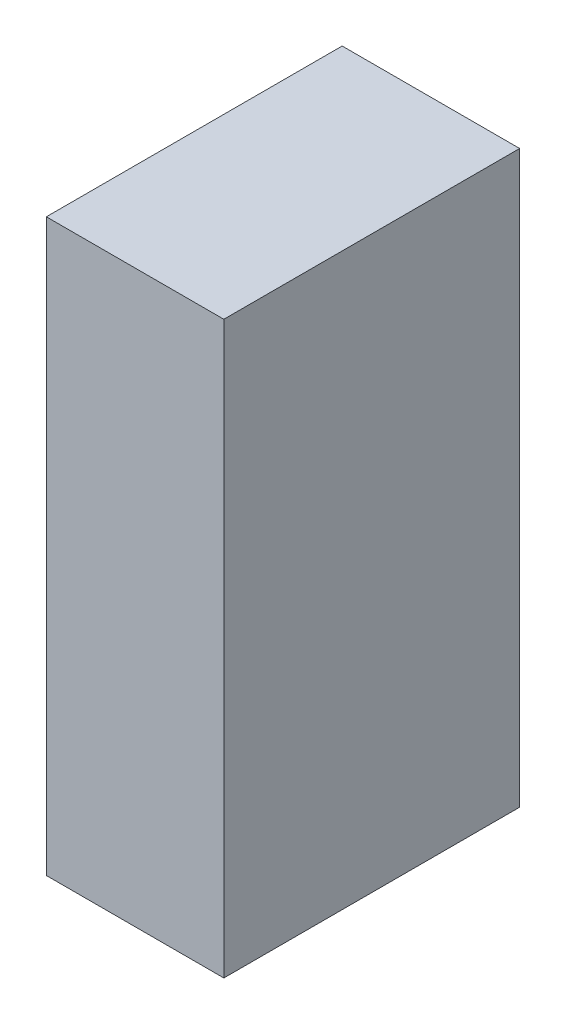
ISO-10303-21;
HEADER;
FILE_DESCRIPTION(('STEP AP214'),'2;1');
FILE_NAME('part.step','',(''),(''),'','','');
FILE_SCHEMA(('AUTOMOTIVE_DESIGN { 1 0 10303 214 1 1 1 1 }'));
ENDSEC;
DATA;
#1=APPLICATION_CONTEXT('core data for automotive mechanical design processes');
#2=APPLICATION_PROTOCOL_DEFINITION('international standard','automotive_design',2000,#1);
#3=PRODUCT_CONTEXT('',#1,'mechanical');
#4=PRODUCT('Part','Part','',(#3));
#5=PRODUCT_RELATED_PRODUCT_CATEGORY('part','',(#4));
#6=PRODUCT_DEFINITION_FORMATION('','',#4);
#7=PRODUCT_DEFINITION_CONTEXT('part definition',#1,'design');
#8=PRODUCT_DEFINITION('design','',#6,#7);
#9=PRODUCT_DEFINITION_SHAPE('','',#8);
#10=(LENGTH_UNIT() NAMED_UNIT(*) SI_UNIT(.MILLI.,.METRE.));
#11=(NAMED_UNIT(*) PLANE_ANGLE_UNIT() SI_UNIT($,.RADIAN.));
#12=(NAMED_UNIT(*) SI_UNIT($,.STERADIAN.) SOLID_ANGLE_UNIT());
#13=UNCERTAINTY_MEASURE_WITH_UNIT(LENGTH_MEASURE(1.E-05),#10,'distance_accuracy_value','');
#14=(GEOMETRIC_REPRESENTATION_CONTEXT(3) GLOBAL_UNCERTAINTY_ASSIGNED_CONTEXT((#13)) GLOBAL_UNIT_ASSIGNED_CONTEXT((#10,
#11,#12)) REPRESENTATION_CONTEXT('',''));
#15=CARTESIAN_POINT('',(0.,0.,0.));
#16=DIRECTION('',(0.,0.,1.));
#17=DIRECTION('',(1.,0.,0.));
#18=AXIS2_PLACEMENT_3D('',#15,#16,#17);
#19=CARTESIAN_POINT('',(0.21000212,0.67499992,0.));
#20=DIRECTION('',(1.,0.,0.));
#21=DIRECTION('',(0.,-1.,0.));
#22=AXIS2_PLACEMENT_3D('',#19,#20,#21);
#23=PLANE('',#22);
#24=DIRECTION('',(0.,0.,1.));
#25=VECTOR('',#24,1.);
#26=CARTESIAN_POINT('',(0.21000212,0.67499992,0.));
#27=LINE('',#26,#25);
#28=CARTESIAN_POINT('',(0.21000212,0.67499992,0.));
#29=VERTEX_POINT('',#28);
#30=CARTESIAN_POINT('',(0.21000212,0.67499992,0.70000114));
#31=VERTEX_POINT('',#30);
#32=EDGE_CURVE('E11',#29,#31,#27,.T.);
#33=ORIENTED_EDGE('',*,*,#32,.T.);
#34=DIRECTION('',(0.,-1.,0.));
#35=VECTOR('',#34,1.);
#36=CARTESIAN_POINT('',(0.21000212,0.67499992,0.70000114));
#37=LINE('',#36,#35);
#38=CARTESIAN_POINT('',(0.21000212,-0.67499992,0.70000114));
#39=VERTEX_POINT('',#38);
#40=EDGE_CURVE('E24',#31,#39,#37,.T.);
#41=ORIENTED_EDGE('',*,*,#40,.T.);
#42=DIRECTION('',(0.,0.,1.));
#43=VECTOR('',#42,1.);
#44=CARTESIAN_POINT('',(0.21000212,-0.67499992,0.));
#45=LINE('',#44,#43);
#46=CARTESIAN_POINT('',(0.21000212,-0.67499992,0.));
#47=VERTEX_POINT('',#46);
#48=EDGE_CURVE('E85',#47,#39,#45,.T.);
#49=ORIENTED_EDGE('',*,*,#48,.F.);
#50=DIRECTION('',(0.,-1.,0.));
#51=VECTOR('',#50,1.);
#52=CARTESIAN_POINT('',(0.21000212,0.67499992,0.));
#53=LINE('',#52,#51);
#54=EDGE_CURVE('E83',#29,#47,#53,.T.);
#55=ORIENTED_EDGE('',*,*,#54,.F.);
#56=EDGE_LOOP('',(#33,#41,#49,#55));
#57=FACE_BOUND('',#56,.T.);
#58=ADVANCED_FACE('F17',(#57),#23,.T.);
#59=CARTESIAN_POINT('',(0.21000212,-0.67499992,0.));
#60=DIRECTION('',(0.,-1.,0.));
#61=DIRECTION('',(-1.,0.,0.));
#62=AXIS2_PLACEMENT_3D('',#59,#60,#61);
#63=PLANE('',#62);
#64=ORIENTED_EDGE('',*,*,#48,.T.);
#65=DIRECTION('',(-1.,0.,0.));
#66=VECTOR('',#65,1.);
#67=CARTESIAN_POINT('',(0.21000212,-0.67499992,0.70000114));
#68=LINE('',#67,#66);
#69=CARTESIAN_POINT('',(-0.20999704,-0.67499992,0.70000114));
#70=VERTEX_POINT('',#69);
#71=EDGE_CURVE('E81',#39,#70,#68,.T.);
#72=ORIENTED_EDGE('',*,*,#71,.T.);
#73=DIRECTION('',(0.,0.,1.));
#74=VECTOR('',#73,1.);
#75=CARTESIAN_POINT('',(-0.20999704,-0.67499992,0.));
#76=LINE('',#75,#74);
#77=CARTESIAN_POINT('',(-0.20999704,-0.67499992,0.));
#78=VERTEX_POINT('',#77);
#79=EDGE_CURVE('E79',#78,#70,#76,.T.);
#80=ORIENTED_EDGE('',*,*,#79,.F.);
#81=DIRECTION('',(-1.,0.,0.));
#82=VECTOR('',#81,1.);
#83=CARTESIAN_POINT('',(0.21000212,-0.67499992,0.));
#84=LINE('',#83,#82);
#85=EDGE_CURVE('E70',#47,#78,#84,.T.);
#86=ORIENTED_EDGE('',*,*,#85,.F.);
#87=EDGE_LOOP('',(#64,#72,#80,#86));
#88=FACE_BOUND('',#87,.T.);
#89=ADVANCED_FACE('F90',(#88),#63,.T.);
#90=CARTESIAN_POINT('',(-0.20999704,-0.67499992,0.));
#91=DIRECTION('',(-0.99999999999823,-1.88148170224543E-06,0.));
#92=DIRECTION('',(-1.88148170224543E-06,0.99999999999823,0.));
#93=AXIS2_PLACEMENT_3D('',#90,#91,#92);
#94=PLANE('',#93);
#95=ORIENTED_EDGE('',*,*,#79,.T.);
#96=DIRECTION('',(-1.88148170224543E-06,0.99999999999823,0.));
#97=VECTOR('',#96,1.);
#98=CARTESIAN_POINT('',(-0.20999704,-0.67499992,0.70000114));
#99=LINE('',#98,#97);
#100=CARTESIAN_POINT('',(-0.20999958,0.67499992,0.70000114));
#101=VERTEX_POINT('',#100);
#102=EDGE_CURVE('E60',#70,#101,#99,.T.);
#103=ORIENTED_EDGE('',*,*,#102,.T.);
#104=DIRECTION('',(0.,0.,1.));
#105=VECTOR('',#104,1.);
#106=CARTESIAN_POINT('',(-0.20999958,0.67499992,0.));
#107=LINE('',#106,#105);
#108=CARTESIAN_POINT('',(-0.20999958,0.67499992,0.));
#109=VERTEX_POINT('',#108);
#110=EDGE_CURVE('E54',#109,#101,#107,.T.);
#111=ORIENTED_EDGE('',*,*,#110,.F.);
#112=DIRECTION('',(-1.88148170224543E-06,0.99999999999823,0.));
#113=VECTOR('',#112,1.);
#114=CARTESIAN_POINT('',(-0.20999704,-0.67499992,0.));
#115=LINE('',#114,#113);
#116=EDGE_CURVE('E58',#78,#109,#115,.T.);
#117=ORIENTED_EDGE('',*,*,#116,.F.);
#118=EDGE_LOOP('',(#95,#103,#111,#117));
#119=FACE_BOUND('',#118,.T.);
#120=ADVANCED_FACE('F57',(#119),#94,.T.);
#121=CARTESIAN_POINT('',(-0.20999958,0.67499992,0.));
#122=DIRECTION('',(0.,1.,0.));
#123=DIRECTION('',(1.,0.,0.));
#124=AXIS2_PLACEMENT_3D('',#121,#122,#123);
#125=PLANE('',#124);
#126=ORIENTED_EDGE('',*,*,#110,.T.);
#127=DIRECTION('',(1.,0.,0.));
#128=VECTOR('',#127,1.);
#129=CARTESIAN_POINT('',(-0.20999958,0.67499992,0.70000114));
#130=LINE('',#129,#128);
#131=EDGE_CURVE('E71',#101,#31,#130,.T.);
#132=ORIENTED_EDGE('',*,*,#131,.T.);
#133=ORIENTED_EDGE('',*,*,#32,.F.);
#134=DIRECTION('',(1.,0.,0.));
#135=VECTOR('',#134,1.);
#136=CARTESIAN_POINT('',(-0.20999958,0.67499992,0.));
#137=LINE('',#136,#135);
#138=EDGE_CURVE('E68',#109,#29,#137,.T.);
#139=ORIENTED_EDGE('',*,*,#138,.F.);
#140=EDGE_LOOP('',(#126,#132,#133,#139));
#141=FACE_BOUND('',#140,.T.);
#142=ADVANCED_FACE('F73',(#141),#125,.T.);
#143=CARTESIAN_POINT('',(0.21000212,0.67499992,0.));
#144=DIRECTION('',(0.,0.,1.));
#145=DIRECTION('',(1.,0.,0.));
#146=AXIS2_PLACEMENT_3D('',#143,#144,#145);
#147=PLANE('',#146);
#148=ORIENTED_EDGE('',*,*,#54,.T.);
#149=ORIENTED_EDGE('',*,*,#85,.T.);
#150=ORIENTED_EDGE('',*,*,#116,.T.);
#151=ORIENTED_EDGE('',*,*,#138,.T.);
#152=EDGE_LOOP('',(#148,#149,#150,#151));
#153=FACE_BOUND('',#152,.T.);
#154=ADVANCED_FACE('F67',(#153),#147,.F.);
#155=CARTESIAN_POINT('',(0.21000212,0.67499992,0.70000114));
#156=DIRECTION('',(0.,0.,1.));
#157=DIRECTION('',(1.,0.,0.));
#158=AXIS2_PLACEMENT_3D('',#155,#156,#157);
#159=PLANE('',#158);
#160=ORIENTED_EDGE('',*,*,#131,.F.);
#161=ORIENTED_EDGE('',*,*,#102,.F.);
#162=ORIENTED_EDGE('',*,*,#71,.F.);
#163=ORIENTED_EDGE('',*,*,#40,.F.);
#164=EDGE_LOOP('',(#160,#161,#162,#163));
#165=FACE_BOUND('',#164,.T.);
#166=ADVANCED_FACE('F91',(#165),#159,.T.);
#167=CLOSED_SHELL('',(#58,#89,#120,#142,#154,#166));
#168=MANIFOLD_SOLID_BREP('B1',#167);
#169=ADVANCED_BREP_SHAPE_REPRESENTATION('',(#18,#168),#14);
#170=SHAPE_DEFINITION_REPRESENTATION(#9,#169);
ENDSEC;
END-ISO-10303-21;
